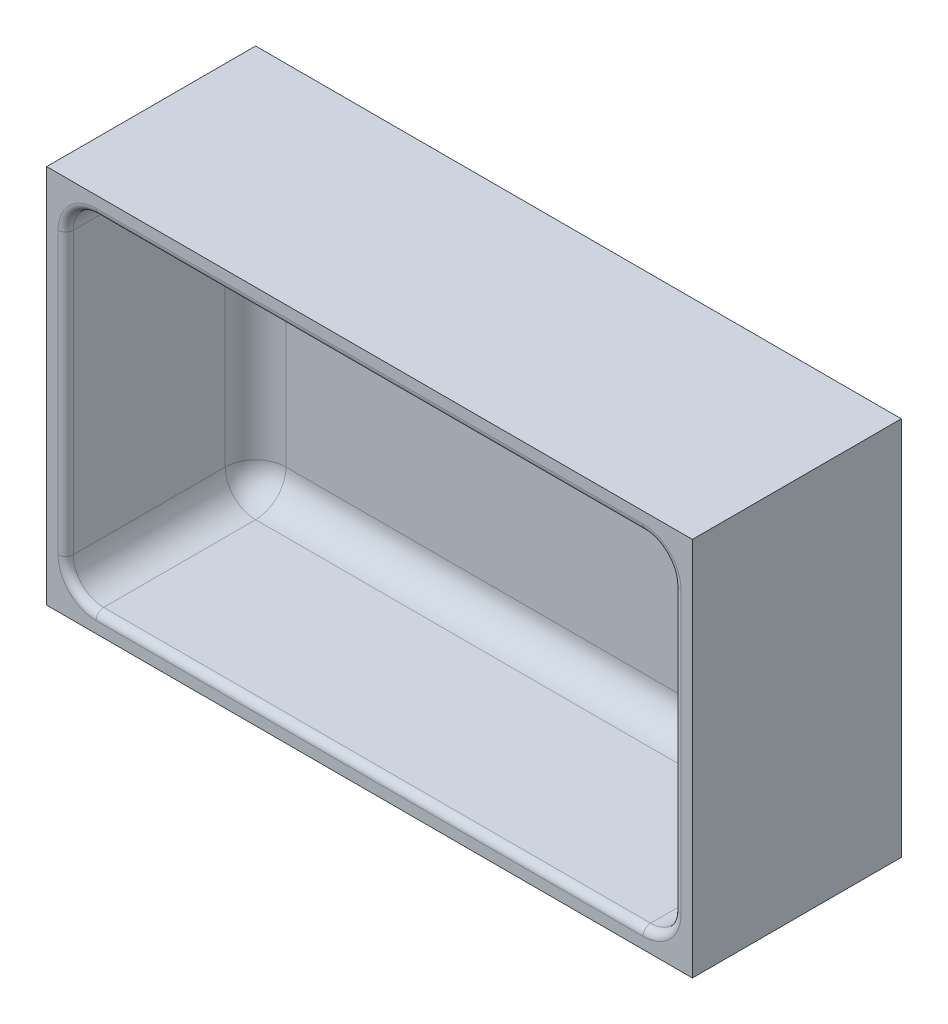
ISO-10303-21;
HEADER;
FILE_DESCRIPTION(('STEP AP214'),'2;1');
FILE_NAME('part.step','',(''),(''),'','','');
FILE_SCHEMA(('AUTOMOTIVE_DESIGN { 1 0 10303 214 1 1 1 1 }'));
ENDSEC;
DATA;
#1=APPLICATION_CONTEXT('core data for automotive mechanical design processes');
#2=APPLICATION_PROTOCOL_DEFINITION('international standard','automotive_design',2000,#1);
#3=PRODUCT_CONTEXT('',#1,'mechanical');
#4=PRODUCT('Part','Part','',(#3));
#5=PRODUCT_RELATED_PRODUCT_CATEGORY('part','',(#4));
#6=PRODUCT_DEFINITION_FORMATION('','',#4);
#7=PRODUCT_DEFINITION_CONTEXT('part definition',#1,'design');
#8=PRODUCT_DEFINITION('design','',#6,#7);
#9=PRODUCT_DEFINITION_SHAPE('','',#8);
#10=(LENGTH_UNIT() NAMED_UNIT(*) SI_UNIT(.MILLI.,.METRE.));
#11=(NAMED_UNIT(*) PLANE_ANGLE_UNIT() SI_UNIT($,.RADIAN.));
#12=(NAMED_UNIT(*) SI_UNIT($,.STERADIAN.) SOLID_ANGLE_UNIT());
#13=UNCERTAINTY_MEASURE_WITH_UNIT(LENGTH_MEASURE(1.E-05),#10,'distance_accuracy_value','');
#14=(GEOMETRIC_REPRESENTATION_CONTEXT(3) GLOBAL_UNCERTAINTY_ASSIGNED_CONTEXT((#13)) GLOBAL_UNIT_ASSIGNED_CONTEXT((#10,
#11,#12)) REPRESENTATION_CONTEXT('',''));
#15=CARTESIAN_POINT('',(0.,0.,0.));
#16=DIRECTION('',(0.,0.,1.));
#17=DIRECTION('',(1.,0.,0.));
#18=AXIS2_PLACEMENT_3D('',#15,#16,#17);
#19=CARTESIAN_POINT('',(0.,0.,5.));
#20=DIRECTION('',(0.,0.,-1.));
#21=DIRECTION('',(-1.,0.,0.));
#22=AXIS2_PLACEMENT_3D('',#19,#20,#21);
#23=PLANE('',#22);
#24=DIRECTION('',(0.,1.,0.));
#25=VECTOR('',#24,1.);
#26=CARTESIAN_POINT('',(-13.,0.,5.));
#27=LINE('',#26,#25);
#28=CARTESIAN_POINT('',(-13.,13.,5.));
#29=VERTEX_POINT('',#28);
#30=CARTESIAN_POINT('',(-13.,87.,5.));
#31=VERTEX_POINT('',#30);
#32=EDGE_CURVE('E223',#29,#31,#27,.T.);
#33=ORIENTED_EDGE('',*,*,#32,.T.);
#34=DIRECTION('',(1.,0.,0.));
#35=VECTOR('',#34,1.);
#36=CARTESIAN_POINT('',(0.,87.,5.));
#37=LINE('',#36,#35);
#38=CARTESIAN_POINT('',(-157.,87.,5.));
#39=VERTEX_POINT('',#38);
#40=EDGE_CURVE('E228',#31,#39,#37,.F.);
#41=ORIENTED_EDGE('',*,*,#40,.T.);
#42=DIRECTION('',(0.,1.,0.));
#43=VECTOR('',#42,1.);
#44=CARTESIAN_POINT('',(-157.,0.,5.));
#45=LINE('',#44,#43);
#46=CARTESIAN_POINT('',(-157.,13.,5.));
#47=VERTEX_POINT('',#46);
#48=EDGE_CURVE('E225',#39,#47,#45,.F.);
#49=ORIENTED_EDGE('',*,*,#48,.T.);
#50=DIRECTION('',(-1.,0.,0.));
#51=VECTOR('',#50,1.);
#52=CARTESIAN_POINT('',(0.,13.,5.));
#53=LINE('',#52,#51);
#54=EDGE_CURVE('E221',#47,#29,#53,.F.);
#55=ORIENTED_EDGE('',*,*,#54,.T.);
#56=EDGE_LOOP('',(#33,#41,#49,#55));
#57=FACE_BOUND('',#56,.T.);
#58=ADVANCED_FACE('F39',(#57),#23,.F.);
#59=CARTESIAN_POINT('',(-5.,5.,55.));
#60=DIRECTION('',(-1.,0.,0.));
#61=DIRECTION('',(0.,0.,1.));
#62=AXIS2_PLACEMENT_3D('',#59,#60,#61);
#63=PLANE('',#62);
#64=DIRECTION('',(0.,0.,-1.));
#65=VECTOR('',#64,1.);
#66=CARTESIAN_POINT('',(-5.,13.,55.));
#67=LINE('',#66,#65);
#68=CARTESIAN_POINT('',(-5.,13.,13.));
#69=VERTEX_POINT('',#68);
#70=CARTESIAN_POINT('',(-5.,13.,53.));
#71=VERTEX_POINT('',#70);
#72=EDGE_CURVE('E192',#69,#71,#67,.F.);
#73=ORIENTED_EDGE('',*,*,#72,.T.);
#74=DIRECTION('',(0.,1.,0.));
#75=VECTOR('',#74,1.);
#76=CARTESIAN_POINT('',(-5.,86.9999999999999,53.));
#77=LINE('',#76,#75);
#78=CARTESIAN_POINT('',(-5.,87.,53.));
#79=VERTEX_POINT('',#78);
#80=EDGE_CURVE('E294',#71,#79,#77,.T.);
#81=ORIENTED_EDGE('',*,*,#80,.T.);
#82=DIRECTION('',(0.,0.,-1.));
#83=VECTOR('',#82,1.);
#84=CARTESIAN_POINT('',(-5.,87.,5.));
#85=LINE('',#84,#83);
#86=CARTESIAN_POINT('',(-5.,87.,13.));
#87=VERTEX_POINT('',#86);
#88=EDGE_CURVE('E199',#79,#87,#85,.T.);
#89=ORIENTED_EDGE('',*,*,#88,.T.);
#90=DIRECTION('',(0.,1.,0.));
#91=VECTOR('',#90,1.);
#92=CARTESIAN_POINT('',(-5.,5.,13.));
#93=LINE('',#92,#91);
#94=EDGE_CURVE('E190',#87,#69,#93,.F.);
#95=ORIENTED_EDGE('',*,*,#94,.T.);
#96=EDGE_LOOP('',(#73,#81,#89,#95));
#97=FACE_BOUND('',#96,.T.);
#98=ADVANCED_FACE('F351',(#97),#63,.T.);
#99=CARTESIAN_POINT('',(-165.,95.,55.));
#100=DIRECTION('',(0.,-1.,0.));
#101=DIRECTION('',(0.,0.,-1.));
#102=AXIS2_PLACEMENT_3D('',#99,#100,#101);
#103=PLANE('',#102);
#104=DIRECTION('',(0.,0.,-1.));
#105=VECTOR('',#104,1.);
#106=CARTESIAN_POINT('',(-13.,95.,55.));
#107=LINE('',#106,#105);
#108=CARTESIAN_POINT('',(-13.,95.,13.));
#109=VERTEX_POINT('',#108);
#110=CARTESIAN_POINT('',(-13.,95.,53.));
#111=VERTEX_POINT('',#110);
#112=EDGE_CURVE('E205',#109,#111,#107,.F.);
#113=ORIENTED_EDGE('',*,*,#112,.T.);
#114=DIRECTION('',(-1.,0.,0.));
#115=VECTOR('',#114,1.);
#116=CARTESIAN_POINT('',(-157.,95.,53.));
#117=LINE('',#116,#115);
#118=CARTESIAN_POINT('',(-157.,95.,53.));
#119=VERTEX_POINT('',#118);
#120=EDGE_CURVE('E290',#111,#119,#117,.T.);
#121=ORIENTED_EDGE('',*,*,#120,.T.);
#122=DIRECTION('',(0.,0.,-1.));
#123=VECTOR('',#122,1.);
#124=CARTESIAN_POINT('',(-157.,95.,5.));
#125=LINE('',#124,#123);
#126=CARTESIAN_POINT('',(-157.,95.,13.));
#127=VERTEX_POINT('',#126);
#128=EDGE_CURVE('E203',#119,#127,#125,.T.);
#129=ORIENTED_EDGE('',*,*,#128,.T.);
#130=DIRECTION('',(1.,0.,0.));
#131=VECTOR('',#130,1.);
#132=CARTESIAN_POINT('',(-165.,95.,13.));
#133=LINE('',#132,#131);
#134=EDGE_CURVE('E201',#127,#109,#133,.T.);
#135=ORIENTED_EDGE('',*,*,#134,.T.);
#136=EDGE_LOOP('',(#113,#121,#129,#135));
#137=FACE_BOUND('',#136,.T.);
#138=ADVANCED_FACE('F334',(#137),#103,.T.);
#139=CARTESIAN_POINT('',(-165.,5.,55.));
#140=DIRECTION('',(1.,0.,0.));
#141=DIRECTION('',(0.,0.,-1.));
#142=AXIS2_PLACEMENT_3D('',#139,#140,#141);
#143=PLANE('',#142);
#144=DIRECTION('',(0.,0.,-1.));
#145=VECTOR('',#144,1.);
#146=CARTESIAN_POINT('',(-165.,87.,55.));
#147=LINE('',#146,#145);
#148=CARTESIAN_POINT('',(-165.,87.,13.));
#149=VERTEX_POINT('',#148);
#150=CARTESIAN_POINT('',(-165.,87.,53.));
#151=VERTEX_POINT('',#150);
#152=EDGE_CURVE('E218',#149,#151,#147,.F.);
#153=ORIENTED_EDGE('',*,*,#152,.T.);
#154=DIRECTION('',(0.,-1.,0.));
#155=VECTOR('',#154,1.);
#156=CARTESIAN_POINT('',(-165.,13.,53.));
#157=LINE('',#156,#155);
#158=CARTESIAN_POINT('',(-165.,13.,53.));
#159=VERTEX_POINT('',#158);
#160=EDGE_CURVE('E286',#151,#159,#157,.T.);
#161=ORIENTED_EDGE('',*,*,#160,.T.);
#162=DIRECTION('',(0.,0.,-1.));
#163=VECTOR('',#162,1.);
#164=CARTESIAN_POINT('',(-165.,13.,5.));
#165=LINE('',#164,#163);
#166=CARTESIAN_POINT('',(-165.,13.,13.));
#167=VERTEX_POINT('',#166);
#168=EDGE_CURVE('E216',#159,#167,#165,.T.);
#169=ORIENTED_EDGE('',*,*,#168,.T.);
#170=DIRECTION('',(0.,1.,0.));
#171=VECTOR('',#170,1.);
#172=CARTESIAN_POINT('',(-165.,5.,13.));
#173=LINE('',#172,#171);
#174=EDGE_CURVE('E214',#167,#149,#173,.T.);
#175=ORIENTED_EDGE('',*,*,#174,.T.);
#176=EDGE_LOOP('',(#153,#161,#169,#175));
#177=FACE_BOUND('',#176,.T.);
#178=ADVANCED_FACE('F378',(#177),#143,.T.);
#179=CARTESIAN_POINT('',(-5.,5.,55.));
#180=DIRECTION('',(0.,1.,0.));
#181=DIRECTION('',(0.,0.,1.));
#182=AXIS2_PLACEMENT_3D('',#179,#180,#181);
#183=PLANE('',#182);
#184=DIRECTION('',(0.,0.,-1.));
#185=VECTOR('',#184,1.);
#186=CARTESIAN_POINT('',(-157.,5.,55.));
#187=LINE('',#186,#185);
#188=CARTESIAN_POINT('',(-157.,5.,13.));
#189=VERTEX_POINT('',#188);
#190=CARTESIAN_POINT('',(-157.,5.,53.));
#191=VERTEX_POINT('',#190);
#192=EDGE_CURVE('E210',#189,#191,#187,.F.);
#193=ORIENTED_EDGE('',*,*,#192,.T.);
#194=DIRECTION('',(1.,0.,0.));
#195=VECTOR('',#194,1.);
#196=CARTESIAN_POINT('',(-13.,5.,53.));
#197=LINE('',#196,#195);
#198=CARTESIAN_POINT('',(-13.,5.,53.));
#199=VERTEX_POINT('',#198);
#200=EDGE_CURVE('E11',#191,#199,#197,.T.);
#201=ORIENTED_EDGE('',*,*,#200,.T.);
#202=DIRECTION('',(0.,0.,-1.));
#203=VECTOR('',#202,1.);
#204=CARTESIAN_POINT('',(-13.,5.,5.));
#205=LINE('',#204,#203);
#206=CARTESIAN_POINT('',(-13.,5.,13.));
#207=VERTEX_POINT('',#206);
#208=EDGE_CURVE('E212',#199,#207,#205,.T.);
#209=ORIENTED_EDGE('',*,*,#208,.T.);
#210=DIRECTION('',(-1.,0.,0.));
#211=VECTOR('',#210,1.);
#212=CARTESIAN_POINT('',(-5.,5.,13.));
#213=LINE('',#212,#211);
#214=EDGE_CURVE('E208',#207,#189,#213,.T.);
#215=ORIENTED_EDGE('',*,*,#214,.T.);
#216=EDGE_LOOP('',(#193,#201,#209,#215));
#217=FACE_BOUND('',#216,.T.);
#218=ADVANCED_FACE('F362',(#217),#183,.T.);
#219=CARTESIAN_POINT('',(0.,0.,55.));
#220=DIRECTION('',(0.,0.,-1.));
#221=DIRECTION('',(-1.,0.,0.));
#222=AXIS2_PLACEMENT_3D('',#219,#220,#221);
#223=PLANE('',#222);
#224=DIRECTION('',(1.,0.,0.));
#225=VECTOR('',#224,1.);
#226=CARTESIAN_POINT('',(-157.,3.,55.));
#227=LINE('',#226,#225);
#228=CARTESIAN_POINT('',(-13.,3.,55.));
#229=VERTEX_POINT('',#228);
#230=CARTESIAN_POINT('',(-157.,3.,55.));
#231=VERTEX_POINT('',#230);
#232=EDGE_CURVE('E230',#229,#231,#227,.F.);
#233=ORIENTED_EDGE('',*,*,#232,.T.);
#234=CARTESIAN_POINT('',(-157.,13.,55.));
#235=DIRECTION('',(0.,0.,-1.));
#236=DIRECTION('',(-1.,0.,0.));
#237=AXIS2_PLACEMENT_3D('',#234,#235,#236);
#238=CIRCLE('',#237,10.);
#239=CARTESIAN_POINT('',(-167.,13.,55.));
#240=VERTEX_POINT('',#239);
#241=EDGE_CURVE('E280',#231,#240,#238,.T.);
#242=ORIENTED_EDGE('',*,*,#241,.T.);
#243=DIRECTION('',(0.,-1.,0.));
#244=VECTOR('',#243,1.);
#245=CARTESIAN_POINT('',(-167.,86.9999999999999,55.));
#246=LINE('',#245,#244);
#247=CARTESIAN_POINT('',(-167.,87.,55.));
#248=VERTEX_POINT('',#247);
#249=EDGE_CURVE('E278',#240,#248,#246,.F.);
#250=ORIENTED_EDGE('',*,*,#249,.T.);
#251=CARTESIAN_POINT('',(-157.,87.,55.));
#252=DIRECTION('',(0.,0.,-1.));
#253=DIRECTION('',(-1.,0.,0.));
#254=AXIS2_PLACEMENT_3D('',#251,#252,#253);
#255=CIRCLE('',#254,10.);
#256=CARTESIAN_POINT('',(-157.,97.,55.));
#257=VERTEX_POINT('',#256);
#258=EDGE_CURVE('E276',#248,#257,#255,.T.);
#259=ORIENTED_EDGE('',*,*,#258,.T.);
#260=DIRECTION('',(-1.,0.,0.));
#261=VECTOR('',#260,1.);
#262=CARTESIAN_POINT('',(-13.,97.,55.));
#263=LINE('',#262,#261);
#264=CARTESIAN_POINT('',(-13.,97.,55.));
#265=VERTEX_POINT('',#264);
#266=EDGE_CURVE('E274',#257,#265,#263,.F.);
#267=ORIENTED_EDGE('',*,*,#266,.T.);
#268=CARTESIAN_POINT('',(-13.,87.,55.));
#269=DIRECTION('',(0.,0.,-1.));
#270=DIRECTION('',(-1.,0.,0.));
#271=AXIS2_PLACEMENT_3D('',#268,#269,#270);
#272=CIRCLE('',#271,10.);
#273=CARTESIAN_POINT('',(-3.,87.,55.));
#274=VERTEX_POINT('',#273);
#275=EDGE_CURVE('E272',#265,#274,#272,.T.);
#276=ORIENTED_EDGE('',*,*,#275,.T.);
#277=DIRECTION('',(0.,1.,0.));
#278=VECTOR('',#277,1.);
#279=CARTESIAN_POINT('',(-3.,13.,55.));
#280=LINE('',#279,#278);
#281=CARTESIAN_POINT('',(-3.,13.,55.));
#282=VERTEX_POINT('',#281);
#283=EDGE_CURVE('E270',#274,#282,#280,.F.);
#284=ORIENTED_EDGE('',*,*,#283,.T.);
#285=CARTESIAN_POINT('',(-13.,13.,55.));
#286=DIRECTION('',(0.,0.,-1.));
#287=DIRECTION('',(-1.,0.,0.));
#288=AXIS2_PLACEMENT_3D('',#285,#286,#287);
#289=CIRCLE('',#288,10.);
#290=EDGE_CURVE('E268',#282,#229,#289,.T.);
#291=ORIENTED_EDGE('',*,*,#290,.T.);
#292=EDGE_LOOP('',(#233,#242,#250,#259,#267,#276,#284,#291));
#293=FACE_BOUND('',#292,.T.);
#294=DIRECTION('',(1.,0.,0.));
#295=VECTOR('',#294,1.);
#296=CARTESIAN_POINT('',(0.,0.,55.));
#297=LINE('',#296,#295);
#298=CARTESIAN_POINT('',(-170.,0.,55.));
#299=VERTEX_POINT('',#298);
#300=CARTESIAN_POINT('',(0.,0.,55.));
#301=VERTEX_POINT('',#300);
#302=EDGE_CURVE('E176',#299,#301,#297,.T.);
#303=ORIENTED_EDGE('',*,*,#302,.T.);
#304=DIRECTION('',(0.,1.,0.));
#305=VECTOR('',#304,1.);
#306=CARTESIAN_POINT('',(0.,0.,55.));
#307=LINE('',#306,#305);
#308=CARTESIAN_POINT('',(0.,100.,55.));
#309=VERTEX_POINT('',#308);
#310=EDGE_CURVE('E165',#301,#309,#307,.T.);
#311=ORIENTED_EDGE('',*,*,#310,.T.);
#312=DIRECTION('',(-1.,0.,0.));
#313=VECTOR('',#312,1.);
#314=CARTESIAN_POINT('',(-170.,100.,55.));
#315=LINE('',#314,#313);
#316=CARTESIAN_POINT('',(-170.,100.,55.));
#317=VERTEX_POINT('',#316);
#318=EDGE_CURVE('E175',#309,#317,#315,.T.);
#319=ORIENTED_EDGE('',*,*,#318,.T.);
#320=DIRECTION('',(0.,-1.,0.));
#321=VECTOR('',#320,1.);
#322=CARTESIAN_POINT('',(-170.,0.,55.));
#323=LINE('',#322,#321);
#324=EDGE_CURVE('E181',#317,#299,#323,.T.);
#325=ORIENTED_EDGE('',*,*,#324,.T.);
#326=EDGE_LOOP('',(#303,#311,#319,#325));
#327=FACE_BOUND('',#326,.T.);
#328=ADVANCED_FACE('F179',(#293,#327),#223,.F.);
#329=CARTESIAN_POINT('',(0.,0.,55.));
#330=DIRECTION('',(0.,1.,0.));
#331=DIRECTION('',(0.,0.,1.));
#332=AXIS2_PLACEMENT_3D('',#329,#330,#331);
#333=PLANE('',#332);
#334=DIRECTION('',(1.,0.,0.));
#335=VECTOR('',#334,1.);
#336=CARTESIAN_POINT('',(0.,0.,0.));
#337=LINE('',#336,#335);
#338=CARTESIAN_POINT('',(-170.,0.,0.));
#339=VERTEX_POINT('',#338);
#340=CARTESIAN_POINT('',(0.,0.,0.));
#341=VERTEX_POINT('',#340);
#342=EDGE_CURVE('E189',#339,#341,#337,.T.);
#343=ORIENTED_EDGE('',*,*,#342,.T.);
#344=DIRECTION('',(0.,0.,-1.));
#345=VECTOR('',#344,1.);
#346=CARTESIAN_POINT('',(0.,0.,55.));
#347=LINE('',#346,#345);
#348=EDGE_CURVE('E169',#301,#341,#347,.T.);
#349=ORIENTED_EDGE('',*,*,#348,.F.);
#350=ORIENTED_EDGE('',*,*,#302,.F.);
#351=DIRECTION('',(0.,0.,-1.));
#352=VECTOR('',#351,1.);
#353=CARTESIAN_POINT('',(-170.,0.,55.));
#354=LINE('',#353,#352);
#355=EDGE_CURVE('E671',#299,#339,#354,.T.);
#356=ORIENTED_EDGE('',*,*,#355,.T.);
#357=EDGE_LOOP('',(#343,#349,#350,#356));
#358=FACE_BOUND('',#357,.T.);
#359=ADVANCED_FACE('F187',(#358),#333,.F.);
#360=CARTESIAN_POINT('',(0.,0.,55.));
#361=DIRECTION('',(-1.,0.,0.));
#362=DIRECTION('',(0.,0.,1.));
#363=AXIS2_PLACEMENT_3D('',#360,#361,#362);
#364=PLANE('',#363);
#365=DIRECTION('',(0.,1.,0.));
#366=VECTOR('',#365,1.);
#367=CARTESIAN_POINT('',(0.,0.,0.));
#368=LINE('',#367,#366);
#369=CARTESIAN_POINT('',(0.,100.,0.));
#370=VERTEX_POINT('',#369);
#371=EDGE_CURVE('E669',#341,#370,#368,.T.);
#372=ORIENTED_EDGE('',*,*,#371,.T.);
#373=DIRECTION('',(0.,0.,-1.));
#374=VECTOR('',#373,1.);
#375=CARTESIAN_POINT('',(0.,100.,55.));
#376=LINE('',#375,#374);
#377=EDGE_CURVE('E172',#309,#370,#376,.T.);
#378=ORIENTED_EDGE('',*,*,#377,.F.);
#379=ORIENTED_EDGE('',*,*,#310,.F.);
#380=ORIENTED_EDGE('',*,*,#348,.T.);
#381=EDGE_LOOP('',(#372,#378,#379,#380));
#382=FACE_BOUND('',#381,.T.);
#383=ADVANCED_FACE('F167',(#382),#364,.F.);
#384=CARTESIAN_POINT('',(-170.,100.,55.));
#385=DIRECTION('',(0.,-1.,0.));
#386=DIRECTION('',(1.,0.,0.));
#387=AXIS2_PLACEMENT_3D('',#384,#385,#386);
#388=PLANE('',#387);
#389=DIRECTION('',(-1.,0.,0.));
#390=VECTOR('',#389,1.);
#391=CARTESIAN_POINT('',(-170.,100.,0.));
#392=LINE('',#391,#390);
#393=CARTESIAN_POINT('',(-170.,100.,0.));
#394=VERTEX_POINT('',#393);
#395=EDGE_CURVE('E666',#370,#394,#392,.T.);
#396=ORIENTED_EDGE('',*,*,#395,.T.);
#397=DIRECTION('',(0.,0.,-1.));
#398=VECTOR('',#397,1.);
#399=CARTESIAN_POINT('',(-170.,100.,55.));
#400=LINE('',#399,#398);
#401=EDGE_CURVE('E194',#317,#394,#400,.T.);
#402=ORIENTED_EDGE('',*,*,#401,.F.);
#403=ORIENTED_EDGE('',*,*,#318,.F.);
#404=ORIENTED_EDGE('',*,*,#377,.T.);
#405=EDGE_LOOP('',(#396,#402,#403,#404));
#406=FACE_BOUND('',#405,.T.);
#407=ADVANCED_FACE('F572',(#406),#388,.F.);
#408=CARTESIAN_POINT('',(-170.,0.,55.));
#409=DIRECTION('',(1.,0.,0.));
#410=DIRECTION('',(0.,0.,-1.));
#411=AXIS2_PLACEMENT_3D('',#408,#409,#410);
#412=PLANE('',#411);
#413=DIRECTION('',(0.,-1.,0.));
#414=VECTOR('',#413,1.);
#415=CARTESIAN_POINT('',(-170.,0.,0.));
#416=LINE('',#415,#414);
#417=EDGE_CURVE('E185',#394,#339,#416,.T.);
#418=ORIENTED_EDGE('',*,*,#417,.T.);
#419=ORIENTED_EDGE('',*,*,#355,.F.);
#420=ORIENTED_EDGE('',*,*,#324,.F.);
#421=ORIENTED_EDGE('',*,*,#401,.T.);
#422=EDGE_LOOP('',(#418,#419,#420,#421));
#423=FACE_BOUND('',#422,.T.);
#424=ADVANCED_FACE('F427',(#423),#412,.F.);
#425=CARTESIAN_POINT('',(0.,0.,0.));
#426=DIRECTION('',(0.,0.,-1.));
#427=DIRECTION('',(-1.,0.,0.));
#428=AXIS2_PLACEMENT_3D('',#425,#426,#427);
#429=PLANE('',#428);
#430=ORIENTED_EDGE('',*,*,#342,.F.);
#431=ORIENTED_EDGE('',*,*,#417,.F.);
#432=ORIENTED_EDGE('',*,*,#395,.F.);
#433=ORIENTED_EDGE('',*,*,#371,.F.);
#434=EDGE_LOOP('',(#430,#431,#432,#433));
#435=FACE_BOUND('',#434,.T.);
#436=ADVANCED_FACE('F425',(#435),#429,.T.);
#437=CARTESIAN_POINT('',(-157.,13.,55.));
#438=DIRECTION('',(0.,0.,1.));
#439=DIRECTION('',(1.,0.,0.));
#440=AXIS2_PLACEMENT_3D('',#437,#438,#439);
#441=CYLINDRICAL_SURFACE('',#440,8.);
#442=ORIENTED_EDGE('',*,*,#168,.F.);
#443=CARTESIAN_POINT('',(-157.,13.,53.));
#444=DIRECTION('',(0.,0.,-1.));
#445=DIRECTION('',(-1.,0.,0.));
#446=AXIS2_PLACEMENT_3D('',#443,#444,#445);
#447=CIRCLE('',#446,8.);
#448=EDGE_CURVE('E283',#159,#191,#447,.F.);
#449=ORIENTED_EDGE('',*,*,#448,.T.);
#450=ORIENTED_EDGE('',*,*,#192,.F.);
#451=CARTESIAN_POINT('',(-157.,13.,13.));
#452=DIRECTION('',(0.,0.,1.));
#453=DIRECTION('',(1.,0.,0.));
#454=AXIS2_PLACEMENT_3D('',#451,#452,#453);
#455=CIRCLE('',#454,8.);
#456=EDGE_CURVE('E264',#167,#189,#455,.T.);
#457=ORIENTED_EDGE('',*,*,#456,.F.);
#458=EDGE_LOOP('',(#442,#449,#450,#457));
#459=FACE_BOUND('',#458,.T.);
#460=ADVANCED_FACE('F366',(#459),#441,.F.);
#461=CARTESIAN_POINT('',(-157.,13.,13.));
#462=DIRECTION('',(0.,-1.,0.));
#463=DIRECTION('',(0.,0.,-1.));
#464=AXIS2_PLACEMENT_3D('',#461,#462,#463);
#465=SPHERICAL_SURFACE('',#464,8.);
#466=CARTESIAN_POINT('',(-157.,13.,13.));
#467=DIRECTION('',(0.,1.,0.));
#468=DIRECTION('',(0.,0.,1.));
#469=AXIS2_PLACEMENT_3D('',#466,#467,#468);
#470=CIRCLE('',#469,8.);
#471=EDGE_CURVE('E258',#167,#47,#470,.F.);
#472=ORIENTED_EDGE('',*,*,#471,.F.);
#473=ORIENTED_EDGE('',*,*,#456,.T.);
#474=CARTESIAN_POINT('',(-157.,13.,13.));
#475=DIRECTION('',(1.,0.,0.));
#476=DIRECTION('',(0.,0.,-1.));
#477=AXIS2_PLACEMENT_3D('',#474,#475,#476);
#478=CIRCLE('',#477,8.);
#479=EDGE_CURVE('E261',#47,#189,#478,.F.);
#480=ORIENTED_EDGE('',*,*,#479,.F.);
#481=EDGE_LOOP('',(#472,#473,#480));
#482=FACE_BOUND('',#481,.T.);
#483=ADVANCED_FACE('F370',(#482),#465,.F.);
#484=CARTESIAN_POINT('',(-13.,13.,55.));
#485=DIRECTION('',(0.,0.,1.));
#486=DIRECTION('',(1.,0.,0.));
#487=AXIS2_PLACEMENT_3D('',#484,#485,#486);
#488=CYLINDRICAL_SURFACE('',#487,8.);
#489=ORIENTED_EDGE('',*,*,#208,.F.);
#490=CARTESIAN_POINT('',(-13.,13.,53.));
#491=DIRECTION('',(0.,0.,-1.));
#492=DIRECTION('',(-1.,0.,0.));
#493=AXIS2_PLACEMENT_3D('',#490,#491,#492);
#494=CIRCLE('',#493,8.);
#495=EDGE_CURVE('E48',#199,#71,#494,.F.);
#496=ORIENTED_EDGE('',*,*,#495,.T.);
#497=ORIENTED_EDGE('',*,*,#72,.F.);
#498=CARTESIAN_POINT('',(-13.,13.,13.));
#499=DIRECTION('',(0.,0.,1.));
#500=DIRECTION('',(1.,0.,0.));
#501=AXIS2_PLACEMENT_3D('',#498,#499,#500);
#502=CIRCLE('',#501,8.);
#503=EDGE_CURVE('E255',#207,#69,#502,.T.);
#504=ORIENTED_EDGE('',*,*,#503,.F.);
#505=EDGE_LOOP('',(#489,#496,#497,#504));
#506=FACE_BOUND('',#505,.T.);
#507=ADVANCED_FACE('F353',(#506),#488,.F.);
#508=CARTESIAN_POINT('',(-5.,13.,13.));
#509=DIRECTION('',(-1.,0.,0.));
#510=DIRECTION('',(0.,0.,1.));
#511=AXIS2_PLACEMENT_3D('',#508,#509,#510);
#512=CYLINDRICAL_SURFACE('',#511,8.);
#513=ORIENTED_EDGE('',*,*,#479,.T.);
#514=ORIENTED_EDGE('',*,*,#214,.F.);
#515=CARTESIAN_POINT('',(-13.,13.,13.));
#516=DIRECTION('',(-1.,0.,0.));
#517=DIRECTION('',(0.,0.,1.));
#518=AXIS2_PLACEMENT_3D('',#515,#516,#517);
#519=CIRCLE('',#518,8.);
#520=EDGE_CURVE('E252',#29,#207,#519,.T.);
#521=ORIENTED_EDGE('',*,*,#520,.F.);
#522=ORIENTED_EDGE('',*,*,#54,.F.);
#523=EDGE_LOOP('',(#513,#514,#521,#522));
#524=FACE_BOUND('',#523,.T.);
#525=ADVANCED_FACE('F359',(#524),#512,.F.);
#526=CARTESIAN_POINT('',(-157.,5.,13.));
#527=DIRECTION('',(0.,1.,0.));
#528=DIRECTION('',(0.,0.,1.));
#529=AXIS2_PLACEMENT_3D('',#526,#527,#528);
#530=CYLINDRICAL_SURFACE('',#529,8.);
#531=ORIENTED_EDGE('',*,*,#471,.T.);
#532=ORIENTED_EDGE('',*,*,#48,.F.);
#533=CARTESIAN_POINT('',(-157.,87.,13.));
#534=DIRECTION('',(0.,-1.,0.));
#535=DIRECTION('',(0.,0.,-1.));
#536=AXIS2_PLACEMENT_3D('',#533,#534,#535);
#537=CIRCLE('',#536,8.);
#538=EDGE_CURVE('E249',#149,#39,#537,.T.);
#539=ORIENTED_EDGE('',*,*,#538,.F.);
#540=ORIENTED_EDGE('',*,*,#174,.F.);
#541=EDGE_LOOP('',(#531,#532,#539,#540));
#542=FACE_BOUND('',#541,.T.);
#543=ADVANCED_FACE('F375',(#542),#530,.F.);
#544=CARTESIAN_POINT('',(-157.,87.,55.));
#545=DIRECTION('',(0.,0.,1.));
#546=DIRECTION('',(1.,0.,0.));
#547=AXIS2_PLACEMENT_3D('',#544,#545,#546);
#548=CYLINDRICAL_SURFACE('',#547,8.);
#549=ORIENTED_EDGE('',*,*,#128,.F.);
#550=CARTESIAN_POINT('',(-157.,87.,53.));
#551=DIRECTION('',(0.,0.,-1.));
#552=DIRECTION('',(-1.,0.,0.));
#553=AXIS2_PLACEMENT_3D('',#550,#551,#552);
#554=CIRCLE('',#553,8.);
#555=EDGE_CURVE('E288',#119,#151,#554,.F.);
#556=ORIENTED_EDGE('',*,*,#555,.T.);
#557=ORIENTED_EDGE('',*,*,#152,.F.);
#558=CARTESIAN_POINT('',(-157.,87.,13.));
#559=DIRECTION('',(0.,0.,1.));
#560=DIRECTION('',(1.,0.,0.));
#561=AXIS2_PLACEMENT_3D('',#558,#559,#560);
#562=CIRCLE('',#561,8.);
#563=EDGE_CURVE('E246',#127,#149,#562,.T.);
#564=ORIENTED_EDGE('',*,*,#563,.F.);
#565=EDGE_LOOP('',(#549,#556,#557,#564));
#566=FACE_BOUND('',#565,.T.);
#567=ADVANCED_FACE('F381',(#566),#548,.F.);
#568=CARTESIAN_POINT('',(-13.,13.,13.));
#569=DIRECTION('',(0.,-1.,0.));
#570=DIRECTION('',(0.,0.,-1.));
#571=AXIS2_PLACEMENT_3D('',#568,#569,#570);
#572=SPHERICAL_SURFACE('',#571,8.);
#573=ORIENTED_EDGE('',*,*,#520,.T.);
#574=ORIENTED_EDGE('',*,*,#503,.T.);
#575=CARTESIAN_POINT('',(-13.,13.,13.));
#576=DIRECTION('',(0.,1.,0.));
#577=DIRECTION('',(0.,0.,1.));
#578=AXIS2_PLACEMENT_3D('',#575,#576,#577);
#579=CIRCLE('',#578,8.);
#580=EDGE_CURVE('E243',#29,#69,#579,.F.);
#581=ORIENTED_EDGE('',*,*,#580,.F.);
#582=EDGE_LOOP('',(#573,#574,#581));
#583=FACE_BOUND('',#582,.T.);
#584=ADVANCED_FACE('F355',(#583),#572,.F.);
#585=CARTESIAN_POINT('',(-157.,87.,13.));
#586=DIRECTION('',(-1.,0.,0.));
#587=DIRECTION('',(0.,0.,1.));
#588=AXIS2_PLACEMENT_3D('',#585,#586,#587);
#589=SPHERICAL_SURFACE('',#588,8.);
#590=ORIENTED_EDGE('',*,*,#563,.T.);
#591=ORIENTED_EDGE('',*,*,#538,.T.);
#592=CARTESIAN_POINT('',(-157.,87.,13.));
#593=DIRECTION('',(1.,0.,0.));
#594=DIRECTION('',(0.,0.,-1.));
#595=AXIS2_PLACEMENT_3D('',#592,#593,#594);
#596=CIRCLE('',#595,8.);
#597=EDGE_CURVE('E240',#127,#39,#596,.F.);
#598=ORIENTED_EDGE('',*,*,#597,.F.);
#599=EDGE_LOOP('',(#590,#591,#598));
#600=FACE_BOUND('',#599,.T.);
#601=ADVANCED_FACE('F437',(#600),#589,.F.);
#602=CARTESIAN_POINT('',(-13.,0.,13.));
#603=DIRECTION('',(0.,1.,0.));
#604=DIRECTION('',(0.,0.,1.));
#605=AXIS2_PLACEMENT_3D('',#602,#603,#604);
#606=CYLINDRICAL_SURFACE('',#605,8.);
#607=ORIENTED_EDGE('',*,*,#580,.T.);
#608=ORIENTED_EDGE('',*,*,#94,.F.);
#609=CARTESIAN_POINT('',(-13.,87.,13.));
#610=DIRECTION('',(0.,-1.,0.));
#611=DIRECTION('',(0.,0.,-1.));
#612=AXIS2_PLACEMENT_3D('',#609,#610,#611);
#613=CIRCLE('',#612,8.);
#614=EDGE_CURVE('E237',#31,#87,#613,.T.);
#615=ORIENTED_EDGE('',*,*,#614,.F.);
#616=ORIENTED_EDGE('',*,*,#32,.F.);
#617=EDGE_LOOP('',(#607,#608,#615,#616));
#618=FACE_BOUND('',#617,.T.);
#619=ADVANCED_FACE('F348',(#618),#606,.F.);
#620=CARTESIAN_POINT('',(-165.,87.,13.));
#621=DIRECTION('',(1.,0.,0.));
#622=DIRECTION('',(0.,0.,-1.));
#623=AXIS2_PLACEMENT_3D('',#620,#621,#622);
#624=CYLINDRICAL_SURFACE('',#623,8.);
#625=ORIENTED_EDGE('',*,*,#597,.T.);
#626=ORIENTED_EDGE('',*,*,#40,.F.);
#627=CARTESIAN_POINT('',(-13.,87.,13.));
#628=DIRECTION('',(-1.,0.,0.));
#629=DIRECTION('',(0.,0.,1.));
#630=AXIS2_PLACEMENT_3D('',#627,#628,#629);
#631=CIRCLE('',#630,8.);
#632=EDGE_CURVE('E234',#109,#31,#631,.T.);
#633=ORIENTED_EDGE('',*,*,#632,.F.);
#634=ORIENTED_EDGE('',*,*,#134,.F.);
#635=EDGE_LOOP('',(#625,#626,#633,#634));
#636=FACE_BOUND('',#635,.T.);
#637=ADVANCED_FACE('F341',(#636),#624,.F.);
#638=CARTESIAN_POINT('',(-13.,87.,13.));
#639=DIRECTION('',(0.,0.,-1.));
#640=DIRECTION('',(-1.,0.,0.));
#641=AXIS2_PLACEMENT_3D('',#638,#639,#640);
#642=SPHERICAL_SURFACE('',#641,8.);
#643=ORIENTED_EDGE('',*,*,#632,.T.);
#644=ORIENTED_EDGE('',*,*,#614,.T.);
#645=CARTESIAN_POINT('',(-13.,87.,13.));
#646=DIRECTION('',(0.,0.,1.));
#647=DIRECTION('',(0.,-1.,0.));
#648=AXIS2_PLACEMENT_3D('',#645,#646,#647);
#649=CIRCLE('',#648,8.);
#650=EDGE_CURVE('E231',#109,#87,#649,.F.);
#651=ORIENTED_EDGE('',*,*,#650,.F.);
#652=EDGE_LOOP('',(#643,#644,#651));
#653=FACE_BOUND('',#652,.T.);
#654=ADVANCED_FACE('F344',(#653),#642,.F.);
#655=CARTESIAN_POINT('',(-13.,87.,55.));
#656=DIRECTION('',(0.,0.,1.));
#657=DIRECTION('',(1.,0.,0.));
#658=AXIS2_PLACEMENT_3D('',#655,#656,#657);
#659=CYLINDRICAL_SURFACE('',#658,8.);
#660=ORIENTED_EDGE('',*,*,#88,.F.);
#661=CARTESIAN_POINT('',(-13.,87.,53.));
#662=DIRECTION('',(0.,0.,-1.));
#663=DIRECTION('',(-1.,0.,0.));
#664=AXIS2_PLACEMENT_3D('',#661,#662,#663);
#665=CIRCLE('',#664,8.);
#666=EDGE_CURVE('E292',#79,#111,#665,.F.);
#667=ORIENTED_EDGE('',*,*,#666,.T.);
#668=ORIENTED_EDGE('',*,*,#112,.F.);
#669=ORIENTED_EDGE('',*,*,#650,.T.);
#670=EDGE_LOOP('',(#660,#667,#668,#669));
#671=FACE_BOUND('',#670,.T.);
#672=ADVANCED_FACE('F331',(#671),#659,.F.);
#673=CARTESIAN_POINT('',(-13.,87.,53.));
#674=DIRECTION('',(0.,0.,-1.));
#675=DIRECTION('',(-1.,0.,0.));
#676=AXIS2_PLACEMENT_3D('',#673,#674,#675);
#677=TOROIDAL_SURFACE('',#676,10.,2.);
#678=CARTESIAN_POINT('',(-13.,97.,53.));
#679=DIRECTION('',(-1.,0.,0.));
#680=DIRECTION('',(0.,0.,1.));
#681=AXIS2_PLACEMENT_3D('',#678,#679,#680);
#682=CIRCLE('',#681,2.);
#683=EDGE_CURVE('E312',#111,#265,#682,.T.);
#684=ORIENTED_EDGE('',*,*,#683,.F.);
#685=ORIENTED_EDGE('',*,*,#666,.F.);
#686=CARTESIAN_POINT('',(-3.,87.,53.));
#687=DIRECTION('',(0.,-1.,0.));
#688=DIRECTION('',(0.,0.,-1.));
#689=AXIS2_PLACEMENT_3D('',#686,#687,#688);
#690=CIRCLE('',#689,2.);
#691=EDGE_CURVE('E43',#274,#79,#690,.T.);
#692=ORIENTED_EDGE('',*,*,#691,.F.);
#693=ORIENTED_EDGE('',*,*,#275,.F.);
#694=EDGE_LOOP('',(#684,#685,#692,#693));
#695=FACE_BOUND('',#694,.T.);
#696=ADVANCED_FACE('F41',(#695),#677,.T.);
#697=CARTESIAN_POINT('',(-3.,5.,53.));
#698=DIRECTION('',(0.,-1.,0.));
#699=DIRECTION('',(0.,0.,-1.));
#700=AXIS2_PLACEMENT_3D('',#697,#698,#699);
#701=CYLINDRICAL_SURFACE('',#700,2.);
#702=ORIENTED_EDGE('',*,*,#691,.T.);
#703=ORIENTED_EDGE('',*,*,#80,.F.);
#704=CARTESIAN_POINT('',(-3.,13.,53.));
#705=DIRECTION('',(0.,-1.,0.));
#706=DIRECTION('',(0.,0.,-1.));
#707=AXIS2_PLACEMENT_3D('',#704,#705,#706);
#708=CIRCLE('',#707,2.);
#709=EDGE_CURVE('E310',#282,#71,#708,.T.);
#710=ORIENTED_EDGE('',*,*,#709,.F.);
#711=ORIENTED_EDGE('',*,*,#283,.F.);
#712=EDGE_LOOP('',(#702,#703,#710,#711));
#713=FACE_BOUND('',#712,.T.);
#714=ADVANCED_FACE('F323',(#713),#701,.T.);
#715=CARTESIAN_POINT('',(-165.,97.,53.));
#716=DIRECTION('',(1.,0.,0.));
#717=DIRECTION('',(0.,0.,-1.));
#718=AXIS2_PLACEMENT_3D('',#715,#716,#717);
#719=CYLINDRICAL_SURFACE('',#718,2.);
#720=ORIENTED_EDGE('',*,*,#683,.T.);
#721=ORIENTED_EDGE('',*,*,#266,.F.);
#722=CARTESIAN_POINT('',(-157.,97.,53.));
#723=DIRECTION('',(-1.,0.,0.));
#724=DIRECTION('',(0.,0.,1.));
#725=AXIS2_PLACEMENT_3D('',#722,#723,#724);
#726=CIRCLE('',#725,2.);
#727=EDGE_CURVE('E307',#119,#257,#726,.T.);
#728=ORIENTED_EDGE('',*,*,#727,.F.);
#729=ORIENTED_EDGE('',*,*,#120,.F.);
#730=EDGE_LOOP('',(#720,#721,#728,#729));
#731=FACE_BOUND('',#730,.T.);
#732=ADVANCED_FACE('F405',(#731),#719,.T.);
#733=CARTESIAN_POINT('',(-13.,13.,53.));
#734=DIRECTION('',(0.,0.,-1.));
#735=DIRECTION('',(-1.,0.,0.));
#736=AXIS2_PLACEMENT_3D('',#733,#734,#735);
#737=TOROIDAL_SURFACE('',#736,10.,2.);
#738=ORIENTED_EDGE('',*,*,#709,.T.);
#739=ORIENTED_EDGE('',*,*,#495,.F.);
#740=CARTESIAN_POINT('',(-13.,3.,53.));
#741=DIRECTION('',(-1.,0.,0.));
#742=DIRECTION('',(0.,0.,1.));
#743=AXIS2_PLACEMENT_3D('',#740,#741,#742);
#744=CIRCLE('',#743,2.);
#745=EDGE_CURVE('E304',#229,#199,#744,.T.);
#746=ORIENTED_EDGE('',*,*,#745,.F.);
#747=ORIENTED_EDGE('',*,*,#290,.F.);
#748=EDGE_LOOP('',(#738,#739,#746,#747));
#749=FACE_BOUND('',#748,.T.);
#750=ADVANCED_FACE('F403',(#749),#737,.T.);
#751=CARTESIAN_POINT('',(-157.,87.,53.));
#752=DIRECTION('',(0.,0.,-1.));
#753=DIRECTION('',(-1.,0.,0.));
#754=AXIS2_PLACEMENT_3D('',#751,#752,#753);
#755=TOROIDAL_SURFACE('',#754,10.,2.);
#756=ORIENTED_EDGE('',*,*,#727,.T.);
#757=ORIENTED_EDGE('',*,*,#258,.F.);
#758=CARTESIAN_POINT('',(-167.,87.,53.));
#759=DIRECTION('',(0.,-1.,0.));
#760=DIRECTION('',(0.,0.,-1.));
#761=AXIS2_PLACEMENT_3D('',#758,#759,#760);
#762=CIRCLE('',#761,2.);
#763=EDGE_CURVE('E301',#151,#248,#762,.T.);
#764=ORIENTED_EDGE('',*,*,#763,.F.);
#765=ORIENTED_EDGE('',*,*,#555,.F.);
#766=EDGE_LOOP('',(#756,#757,#764,#765));
#767=FACE_BOUND('',#766,.T.);
#768=ADVANCED_FACE('F386',(#767),#755,.T.);
#769=CARTESIAN_POINT('',(-5.,3.,53.));
#770=DIRECTION('',(-1.,0.,0.));
#771=DIRECTION('',(0.,0.,1.));
#772=AXIS2_PLACEMENT_3D('',#769,#770,#771);
#773=CYLINDRICAL_SURFACE('',#772,2.);
#774=ORIENTED_EDGE('',*,*,#745,.T.);
#775=ORIENTED_EDGE('',*,*,#200,.F.);
#776=CARTESIAN_POINT('',(-157.,3.,53.));
#777=DIRECTION('',(-1.,0.,0.));
#778=DIRECTION('',(0.,0.,1.));
#779=AXIS2_PLACEMENT_3D('',#776,#777,#778);
#780=CIRCLE('',#779,2.);
#781=EDGE_CURVE('E299',#231,#191,#780,.T.);
#782=ORIENTED_EDGE('',*,*,#781,.F.);
#783=ORIENTED_EDGE('',*,*,#232,.F.);
#784=EDGE_LOOP('',(#774,#775,#782,#783));
#785=FACE_BOUND('',#784,.T.);
#786=ADVANCED_FACE('F399',(#785),#773,.T.);
#787=CARTESIAN_POINT('',(-167.,5.,53.));
#788=DIRECTION('',(0.,1.,0.));
#789=DIRECTION('',(0.,0.,1.));
#790=AXIS2_PLACEMENT_3D('',#787,#788,#789);
#791=CYLINDRICAL_SURFACE('',#790,2.);
#792=ORIENTED_EDGE('',*,*,#763,.T.);
#793=ORIENTED_EDGE('',*,*,#249,.F.);
#794=CARTESIAN_POINT('',(-167.,13.,53.));
#795=DIRECTION('',(0.,-1.,0.));
#796=DIRECTION('',(0.,0.,-1.));
#797=AXIS2_PLACEMENT_3D('',#794,#795,#796);
#798=CIRCLE('',#797,2.);
#799=EDGE_CURVE('E297',#159,#240,#798,.T.);
#800=ORIENTED_EDGE('',*,*,#799,.F.);
#801=ORIENTED_EDGE('',*,*,#160,.F.);
#802=EDGE_LOOP('',(#792,#793,#800,#801));
#803=FACE_BOUND('',#802,.T.);
#804=ADVANCED_FACE('F392',(#803),#791,.T.);
#805=CARTESIAN_POINT('',(-157.,13.,53.));
#806=DIRECTION('',(0.,0.,-1.));
#807=DIRECTION('',(-1.,0.,0.));
#808=AXIS2_PLACEMENT_3D('',#805,#806,#807);
#809=TOROIDAL_SURFACE('',#808,10.,2.);
#810=ORIENTED_EDGE('',*,*,#781,.T.);
#811=ORIENTED_EDGE('',*,*,#448,.F.);
#812=ORIENTED_EDGE('',*,*,#799,.T.);
#813=ORIENTED_EDGE('',*,*,#241,.F.);
#814=EDGE_LOOP('',(#810,#811,#812,#813));
#815=FACE_BOUND('',#814,.T.);
#816=ADVANCED_FACE('F394',(#815),#809,.T.);
#817=CLOSED_SHELL('',(#58,#98,#138,#178,#218,#328,#359,#383,#407,#424,#436,#460,#483,#507,#525,
#543,#567,#584,#601,#619,#637,#654,#672,#696,#714,#732,#750,#768,#786,#804,#816));
#818=MANIFOLD_SOLID_BREP('B2',#817);
#819=ADVANCED_BREP_SHAPE_REPRESENTATION('',(#18,#818),#14);
#820=SHAPE_DEFINITION_REPRESENTATION(#9,#819);
ENDSEC;
END-ISO-10303-21;
